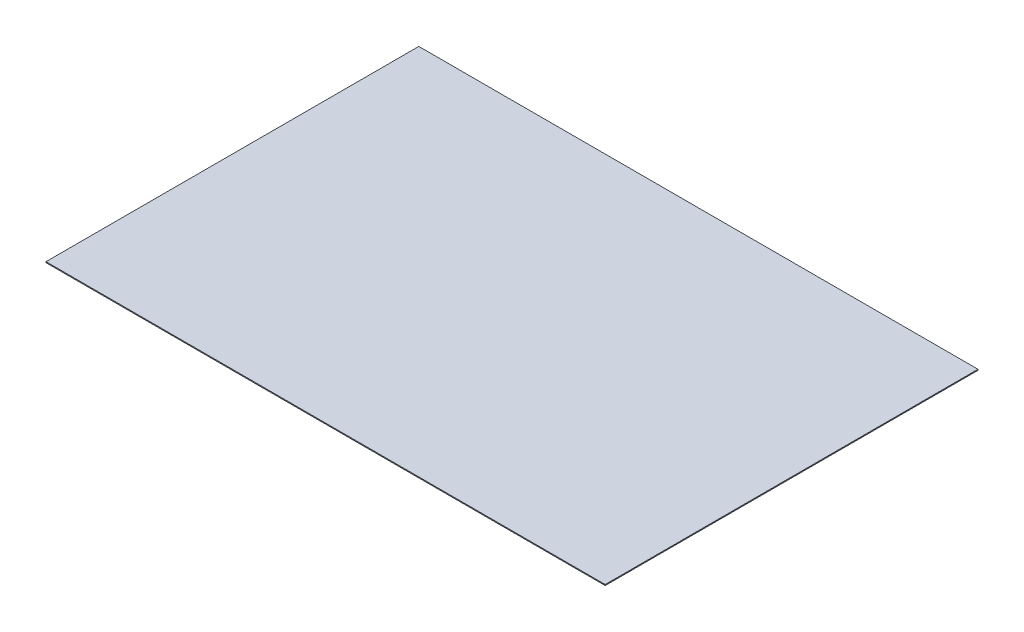
ISO-10303-21;
HEADER;
FILE_DESCRIPTION(('STEP AP214'),'2;1');
FILE_NAME('part.step','',(''),(''),'','','');
FILE_SCHEMA(('AUTOMOTIVE_DESIGN { 1 0 10303 214 1 1 1 1 }'));
ENDSEC;
DATA;
#1=APPLICATION_CONTEXT('core data for automotive mechanical design processes');
#2=APPLICATION_PROTOCOL_DEFINITION('international standard','automotive_design',2000,#1);
#3=PRODUCT_CONTEXT('',#1,'mechanical');
#4=PRODUCT('Part','Part','',(#3));
#5=PRODUCT_RELATED_PRODUCT_CATEGORY('part','',(#4));
#6=PRODUCT_DEFINITION_FORMATION('','',#4);
#7=PRODUCT_DEFINITION_CONTEXT('part definition',#1,'design');
#8=PRODUCT_DEFINITION('design','',#6,#7);
#9=PRODUCT_DEFINITION_SHAPE('','',#8);
#10=(LENGTH_UNIT() NAMED_UNIT(*) SI_UNIT(.MILLI.,.METRE.));
#11=(NAMED_UNIT(*) PLANE_ANGLE_UNIT() SI_UNIT($,.RADIAN.));
#12=(NAMED_UNIT(*) SI_UNIT($,.STERADIAN.) SOLID_ANGLE_UNIT());
#13=UNCERTAINTY_MEASURE_WITH_UNIT(LENGTH_MEASURE(1.E-05),#10,'distance_accuracy_value','');
#14=(GEOMETRIC_REPRESENTATION_CONTEXT(3) GLOBAL_UNCERTAINTY_ASSIGNED_CONTEXT((#13)) GLOBAL_UNIT_ASSIGNED_CONTEXT((#10,
#11,#12)) REPRESENTATION_CONTEXT('',''));
#15=CARTESIAN_POINT('',(0.,0.,0.));
#16=DIRECTION('',(0.,0.,1.));
#17=DIRECTION('',(1.,0.,0.));
#18=AXIS2_PLACEMENT_3D('',#15,#16,#17);
#19=CARTESIAN_POINT('',(228.6,-0.381,152.4));
#20=DIRECTION('',(-1.,0.,0.));
#21=DIRECTION('',(0.,0.,1.));
#22=AXIS2_PLACEMENT_3D('',#19,#20,#21);
#23=PLANE('',#22);
#24=DIRECTION('',(0.,1.,0.));
#25=VECTOR('',#24,1.);
#26=CARTESIAN_POINT('',(228.6,-0.381,-152.4));
#27=LINE('',#26,#25);
#28=CARTESIAN_POINT('',(228.6,-0.381,-152.4));
#29=VERTEX_POINT('',#28);
#30=CARTESIAN_POINT('',(228.6,0.381,-152.4));
#31=VERTEX_POINT('',#30);
#32=EDGE_CURVE('E113',#29,#31,#27,.T.);
#33=ORIENTED_EDGE('',*,*,#32,.T.);
#34=DIRECTION('',(0.,0.,-1.));
#35=VECTOR('',#34,1.);
#36=CARTESIAN_POINT('',(228.6,0.381,152.4));
#37=LINE('',#36,#35);
#38=CARTESIAN_POINT('',(228.6,0.381,152.4));
#39=VERTEX_POINT('',#38);
#40=EDGE_CURVE('E11',#39,#31,#37,.T.);
#41=ORIENTED_EDGE('',*,*,#40,.F.);
#42=DIRECTION('',(0.,1.,0.));
#43=VECTOR('',#42,1.);
#44=CARTESIAN_POINT('',(228.6,-0.381,152.4));
#45=LINE('',#44,#43);
#46=CARTESIAN_POINT('',(228.6,-0.381,152.4));
#47=VERTEX_POINT('',#46);
#48=EDGE_CURVE('E97',#47,#39,#45,.T.);
#49=ORIENTED_EDGE('',*,*,#48,.F.);
#50=DIRECTION('',(0.,0.,-1.));
#51=VECTOR('',#50,1.);
#52=CARTESIAN_POINT('',(228.6,-0.381,152.4));
#53=LINE('',#52,#51);
#54=EDGE_CURVE('E109',#47,#29,#53,.T.);
#55=ORIENTED_EDGE('',*,*,#54,.T.);
#56=EDGE_LOOP('',(#33,#41,#49,#55));
#57=FACE_BOUND('',#56,.T.);
#58=ADVANCED_FACE('F45',(#57),#23,.F.);
#59=CARTESIAN_POINT('',(-228.6,0.381,152.4));
#60=DIRECTION('',(0.,-1.,0.));
#61=DIRECTION('',(0.,0.,-1.));
#62=AXIS2_PLACEMENT_3D('',#59,#60,#61);
#63=PLANE('',#62);
#64=DIRECTION('',(-1.,0.,0.));
#65=VECTOR('',#64,1.);
#66=CARTESIAN_POINT('',(-228.6,0.381,-152.4));
#67=LINE('',#66,#65);
#68=CARTESIAN_POINT('',(-228.6,0.381,-152.4));
#69=VERTEX_POINT('',#68);
#70=EDGE_CURVE('E102',#31,#69,#67,.T.);
#71=ORIENTED_EDGE('',*,*,#70,.T.);
#72=DIRECTION('',(0.,0.,-1.));
#73=VECTOR('',#72,1.);
#74=CARTESIAN_POINT('',(-228.6,0.381,152.4));
#75=LINE('',#74,#73);
#76=CARTESIAN_POINT('',(-228.6,0.381,152.4));
#77=VERTEX_POINT('',#76);
#78=EDGE_CURVE('E54',#77,#69,#75,.T.);
#79=ORIENTED_EDGE('',*,*,#78,.F.);
#80=DIRECTION('',(-1.,0.,0.));
#81=VECTOR('',#80,1.);
#82=CARTESIAN_POINT('',(-228.6,0.381,152.4));
#83=LINE('',#82,#81);
#84=EDGE_CURVE('E92',#39,#77,#83,.T.);
#85=ORIENTED_EDGE('',*,*,#84,.F.);
#86=ORIENTED_EDGE('',*,*,#40,.T.);
#87=EDGE_LOOP('',(#71,#79,#85,#86));
#88=FACE_BOUND('',#87,.T.);
#89=ADVANCED_FACE('F101',(#88),#63,.F.);
#90=CARTESIAN_POINT('',(-228.6,-0.381,152.4));
#91=DIRECTION('',(1.,0.,0.));
#92=DIRECTION('',(0.,0.,-1.));
#93=AXIS2_PLACEMENT_3D('',#90,#91,#92);
#94=PLANE('',#93);
#95=DIRECTION('',(0.,-1.,0.));
#96=VECTOR('',#95,1.);
#97=CARTESIAN_POINT('',(-228.6,-0.381,-152.4));
#98=LINE('',#97,#96);
#99=CARTESIAN_POINT('',(-228.6,-0.381,-152.4));
#100=VERTEX_POINT('',#99);
#101=EDGE_CURVE('E79',#69,#100,#98,.T.);
#102=ORIENTED_EDGE('',*,*,#101,.T.);
#103=DIRECTION('',(0.,0.,-1.));
#104=VECTOR('',#103,1.);
#105=CARTESIAN_POINT('',(-228.6,-0.381,152.4));
#106=LINE('',#105,#104);
#107=CARTESIAN_POINT('',(-228.6,-0.381,152.4));
#108=VERTEX_POINT('',#107);
#109=EDGE_CURVE('E104',#108,#100,#106,.T.);
#110=ORIENTED_EDGE('',*,*,#109,.F.);
#111=DIRECTION('',(0.,-1.,0.));
#112=VECTOR('',#111,1.);
#113=CARTESIAN_POINT('',(-228.6,-0.381,152.4));
#114=LINE('',#113,#112);
#115=EDGE_CURVE('E95',#77,#108,#114,.T.);
#116=ORIENTED_EDGE('',*,*,#115,.F.);
#117=ORIENTED_EDGE('',*,*,#78,.T.);
#118=EDGE_LOOP('',(#102,#110,#116,#117));
#119=FACE_BOUND('',#118,.T.);
#120=ADVANCED_FACE('F105',(#119),#94,.F.);
#121=CARTESIAN_POINT('',(-228.6,-0.381,152.4));
#122=DIRECTION('',(0.,1.,0.));
#123=DIRECTION('',(0.,0.,1.));
#124=AXIS2_PLACEMENT_3D('',#121,#122,#123);
#125=PLANE('',#124);
#126=DIRECTION('',(1.,0.,0.));
#127=VECTOR('',#126,1.);
#128=CARTESIAN_POINT('',(-228.6,-0.381,-152.4));
#129=LINE('',#128,#127);
#130=EDGE_CURVE('E85',#100,#29,#129,.T.);
#131=ORIENTED_EDGE('',*,*,#130,.T.);
#132=ORIENTED_EDGE('',*,*,#54,.F.);
#133=DIRECTION('',(1.,0.,0.));
#134=VECTOR('',#133,1.);
#135=CARTESIAN_POINT('',(-228.6,-0.381,152.4));
#136=LINE('',#135,#134);
#137=EDGE_CURVE('E62',#108,#47,#136,.T.);
#138=ORIENTED_EDGE('',*,*,#137,.F.);
#139=ORIENTED_EDGE('',*,*,#109,.T.);
#140=EDGE_LOOP('',(#131,#132,#138,#139));
#141=FACE_BOUND('',#140,.T.);
#142=ADVANCED_FACE('F126',(#141),#125,.F.);
#143=CARTESIAN_POINT('',(0.,0.,152.4));
#144=DIRECTION('',(0.,0.,-1.));
#145=DIRECTION('',(-1.,0.,0.));
#146=AXIS2_PLACEMENT_3D('',#143,#144,#145);
#147=PLANE('',#146);
#148=ORIENTED_EDGE('',*,*,#48,.T.);
#149=ORIENTED_EDGE('',*,*,#84,.T.);
#150=ORIENTED_EDGE('',*,*,#115,.T.);
#151=ORIENTED_EDGE('',*,*,#137,.T.);
#152=EDGE_LOOP('',(#148,#149,#150,#151));
#153=FACE_BOUND('',#152,.T.);
#154=ADVANCED_FACE('F93',(#153),#147,.F.);
#155=CARTESIAN_POINT('',(0.,0.,-152.4));
#156=DIRECTION('',(0.,0.,-1.));
#157=DIRECTION('',(-1.,0.,0.));
#158=AXIS2_PLACEMENT_3D('',#155,#156,#157);
#159=PLANE('',#158);
#160=ORIENTED_EDGE('',*,*,#32,.F.);
#161=ORIENTED_EDGE('',*,*,#130,.F.);
#162=ORIENTED_EDGE('',*,*,#101,.F.);
#163=ORIENTED_EDGE('',*,*,#70,.F.);
#164=EDGE_LOOP('',(#160,#161,#162,#163));
#165=FACE_BOUND('',#164,.T.);
#166=ADVANCED_FACE('F129',(#165),#159,.T.);
#167=CLOSED_SHELL('',(#58,#89,#120,#142,#154,#166));
#168=MANIFOLD_SOLID_BREP('B2',#167);
#169=ADVANCED_BREP_SHAPE_REPRESENTATION('',(#18,#168),#14);
#170=SHAPE_DEFINITION_REPRESENTATION(#9,#169);
ENDSEC;
END-ISO-10303-21;
